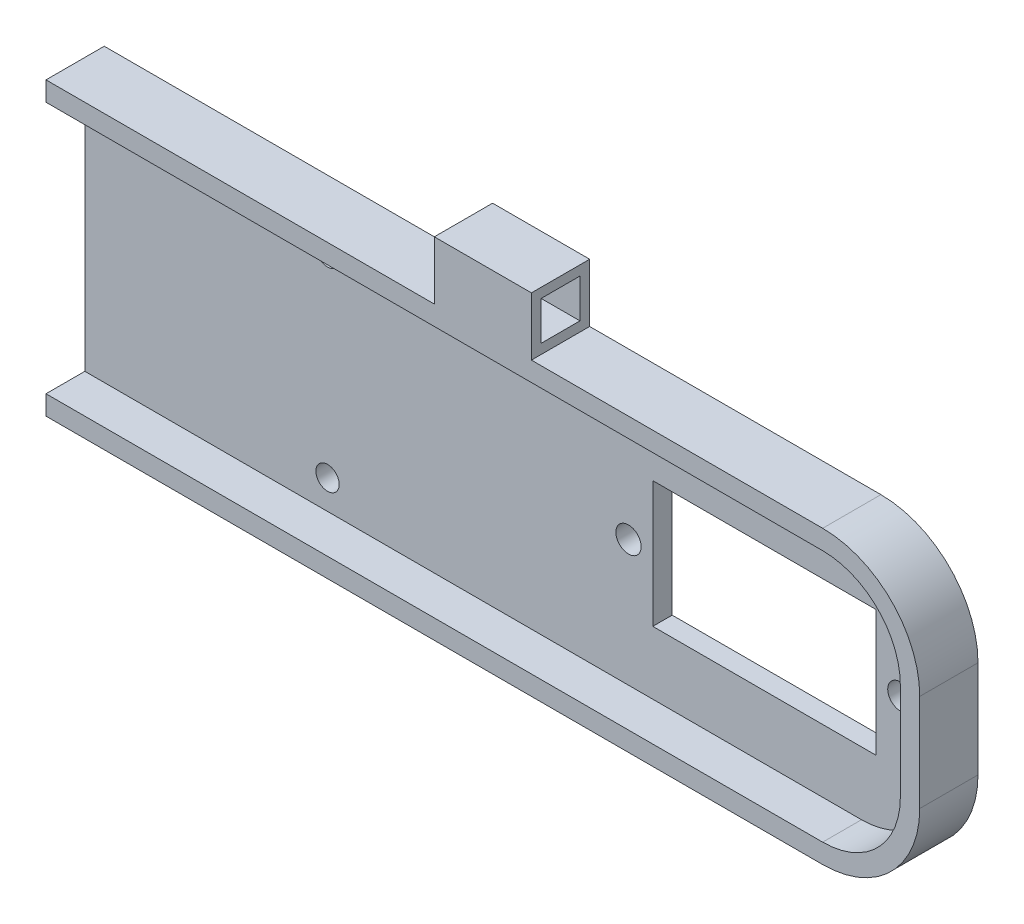
ISO-10303-21;
HEADER;
FILE_DESCRIPTION(('STEP AP214'),'2;1');
FILE_NAME('part.step','',(''),(''),'','','');
FILE_SCHEMA(('AUTOMOTIVE_DESIGN { 1 0 10303 214 1 1 1 1 }'));
ENDSEC;
DATA;
#1=APPLICATION_CONTEXT('core data for automotive mechanical design processes');
#2=APPLICATION_PROTOCOL_DEFINITION('international standard','automotive_design',2000,#1);
#3=PRODUCT_CONTEXT('',#1,'mechanical');
#4=PRODUCT('Part','Part','',(#3));
#5=PRODUCT_RELATED_PRODUCT_CATEGORY('part','',(#4));
#6=PRODUCT_DEFINITION_FORMATION('','',#4);
#7=PRODUCT_DEFINITION_CONTEXT('part definition',#1,'design');
#8=PRODUCT_DEFINITION('design','',#6,#7);
#9=PRODUCT_DEFINITION_SHAPE('','',#8);
#10=(LENGTH_UNIT() NAMED_UNIT(*) SI_UNIT(.MILLI.,.METRE.));
#11=(NAMED_UNIT(*) PLANE_ANGLE_UNIT() SI_UNIT($,.RADIAN.));
#12=(NAMED_UNIT(*) SI_UNIT($,.STERADIAN.) SOLID_ANGLE_UNIT());
#13=UNCERTAINTY_MEASURE_WITH_UNIT(LENGTH_MEASURE(1.E-05),#10,'distance_accuracy_value','');
#14=(GEOMETRIC_REPRESENTATION_CONTEXT(3) GLOBAL_UNCERTAINTY_ASSIGNED_CONTEXT((#13)) GLOBAL_UNIT_ASSIGNED_CONTEXT((#10,
#11,#12)) REPRESENTATION_CONTEXT('',''));
#15=CARTESIAN_POINT('',(0.,0.,0.));
#16=DIRECTION('',(0.,0.,1.));
#17=DIRECTION('',(1.,0.,0.));
#18=AXIS2_PLACEMENT_3D('',#15,#16,#17);
#19=CARTESIAN_POINT('',(80.,0.,0.));
#20=DIRECTION('',(1.,0.,0.));
#21=DIRECTION('',(0.,0.,-1.));
#22=AXIS2_PLACEMENT_3D('',#19,#20,#21);
#23=PLANE('',#22);
#24=DIRECTION('',(0.,0.,1.));
#25=VECTOR('',#24,1.);
#26=CARTESIAN_POINT('',(80.,15.,6.));
#27=LINE('',#26,#25);
#28=CARTESIAN_POINT('',(80.,15.,0.));
#29=VERTEX_POINT('',#28);
#30=CARTESIAN_POINT('',(80.,15.,6.));
#31=VERTEX_POINT('',#30);
#32=EDGE_CURVE('E617',#29,#31,#27,.T.);
#33=ORIENTED_EDGE('',*,*,#32,.F.);
#34=DIRECTION('',(0.,1.,0.));
#35=VECTOR('',#34,1.);
#36=CARTESIAN_POINT('',(80.,0.,0.));
#37=LINE('',#36,#35);
#38=CARTESIAN_POINT('',(80.,-15.,0.));
#39=VERTEX_POINT('',#38);
#40=EDGE_CURVE('E624',#39,#29,#37,.T.);
#41=ORIENTED_EDGE('',*,*,#40,.F.);
#42=DIRECTION('',(0.,0.,-1.));
#43=VECTOR('',#42,1.);
#44=CARTESIAN_POINT('',(80.,-15.,6.));
#45=LINE('',#44,#43);
#46=CARTESIAN_POINT('',(80.,-15.,6.));
#47=VERTEX_POINT('',#46);
#48=EDGE_CURVE('E730',#47,#39,#45,.T.);
#49=ORIENTED_EDGE('',*,*,#48,.F.);
#50=DIRECTION('',(0.,1.,0.));
#51=VECTOR('',#50,1.);
#52=CARTESIAN_POINT('',(80.,0.,6.));
#53=LINE('',#52,#51);
#54=CARTESIAN_POINT('',(80.,-13.,6.));
#55=VERTEX_POINT('',#54);
#56=EDGE_CURVE('E61',#47,#55,#53,.T.);
#57=ORIENTED_EDGE('',*,*,#56,.T.);
#58=DIRECTION('',(0.,0.,1.));
#59=VECTOR('',#58,1.);
#60=CARTESIAN_POINT('',(80.,-13.,2.));
#61=LINE('',#60,#59);
#62=CARTESIAN_POINT('',(80.,-13.,2.));
#63=VERTEX_POINT('',#62);
#64=EDGE_CURVE('E13',#63,#55,#61,.T.);
#65=ORIENTED_EDGE('',*,*,#64,.F.);
#66=DIRECTION('',(0.,1.,0.));
#67=VECTOR('',#66,1.);
#68=CARTESIAN_POINT('',(80.,0.,2.));
#69=LINE('',#68,#67);
#70=CARTESIAN_POINT('',(80.,13.,2.));
#71=VERTEX_POINT('',#70);
#72=EDGE_CURVE('E205',#63,#71,#69,.T.);
#73=ORIENTED_EDGE('',*,*,#72,.T.);
#74=DIRECTION('',(0.,0.,-1.));
#75=VECTOR('',#74,1.);
#76=CARTESIAN_POINT('',(80.,13.,2.));
#77=LINE('',#76,#75);
#78=CARTESIAN_POINT('',(80.,13.,6.));
#79=VERTEX_POINT('',#78);
#80=EDGE_CURVE('E220',#79,#71,#77,.T.);
#81=ORIENTED_EDGE('',*,*,#80,.F.);
#82=EDGE_CURVE('E729',#79,#31,#53,.T.);
#83=ORIENTED_EDGE('',*,*,#82,.T.);
#84=EDGE_LOOP('',(#33,#41,#49,#57,#65,#73,#81,#83));
#85=FACE_BOUND('',#84,.T.);
#86=ADVANCED_FACE('F46',(#85),#23,.F.);
#87=CARTESIAN_POINT('',(-50.,15.,6.));
#88=DIRECTION('',(0.,-1.,0.));
#89=DIRECTION('',(0.,0.,-1.));
#90=AXIS2_PLACEMENT_3D('',#87,#88,#89);
#91=PLANE('',#90);
#92=DIRECTION('',(-1.,0.,0.));
#93=VECTOR('',#92,1.);
#94=CARTESIAN_POINT('',(-50.,15.,0.));
#95=LINE('',#94,#93);
#96=CARTESIAN_POINT('',(120.,15.,0.));
#97=VERTEX_POINT('',#96);
#98=EDGE_CURVE('E278',#97,#29,#95,.T.);
#99=ORIENTED_EDGE('',*,*,#98,.T.);
#100=ORIENTED_EDGE('',*,*,#32,.T.);
#101=DIRECTION('',(-1.,0.,0.));
#102=VECTOR('',#101,1.);
#103=CARTESIAN_POINT('',(-50.,15.,6.));
#104=LINE('',#103,#102);
#105=CARTESIAN_POINT('',(120.,15.,6.));
#106=VERTEX_POINT('',#105);
#107=EDGE_CURVE('E264',#106,#31,#104,.T.);
#108=ORIENTED_EDGE('',*,*,#107,.F.);
#109=DIRECTION('',(0.,0.,-1.));
#110=VECTOR('',#109,1.);
#111=CARTESIAN_POINT('',(120.,15.,6.));
#112=LINE('',#111,#110);
#113=EDGE_CURVE('E68',#106,#97,#112,.T.);
#114=ORIENTED_EDGE('',*,*,#113,.T.);
#115=EDGE_LOOP('',(#99,#100,#108,#114));
#116=FACE_BOUND('',#115,.T.);
#117=ADVANCED_FACE('F357',(#116),#91,.F.);
#118=DIRECTION('',(0.,0.,-1.));
#119=VECTOR('',#118,1.);
#120=CARTESIAN_POINT('',(130.,15.,6.));
#121=LINE('',#120,#119);
#122=CARTESIAN_POINT('',(130.,15.,6.));
#123=VERTEX_POINT('',#122);
#124=CARTESIAN_POINT('',(130.,15.,0.));
#125=VERTEX_POINT('',#124);
#126=EDGE_CURVE('E630',#123,#125,#121,.T.);
#127=ORIENTED_EDGE('',*,*,#126,.F.);
#128=CARTESIAN_POINT('',(160.,15.,6.));
#129=VERTEX_POINT('',#128);
#130=EDGE_CURVE('E267',#129,#123,#104,.T.);
#131=ORIENTED_EDGE('',*,*,#130,.F.);
#132=DIRECTION('',(0.,0.,-1.));
#133=VECTOR('',#132,1.);
#134=CARTESIAN_POINT('',(160.,15.,6.));
#135=LINE('',#134,#133);
#136=CARTESIAN_POINT('',(160.,15.,0.));
#137=VERTEX_POINT('',#136);
#138=EDGE_CURVE('E54',#129,#137,#135,.T.);
#139=ORIENTED_EDGE('',*,*,#138,.T.);
#140=EDGE_CURVE('E280',#137,#125,#95,.T.);
#141=ORIENTED_EDGE('',*,*,#140,.T.);
#142=EDGE_LOOP('',(#127,#131,#139,#141));
#143=FACE_BOUND('',#142,.T.);
#144=ADVANCED_FACE('F362',(#143),#91,.F.);
#145=CARTESIAN_POINT('',(0.,0.,0.));
#146=DIRECTION('',(0.,0.,1.));
#147=DIRECTION('',(1.,0.,0.));
#148=AXIS2_PLACEMENT_3D('',#145,#146,#147);
#149=PLANE('',#148);
#150=CARTESIAN_POINT('',(105.,-9.99999999999999,0.));
#151=DIRECTION('',(0.,0.,1.));
#152=DIRECTION('',(1.,0.,0.));
#153=AXIS2_PLACEMENT_3D('',#150,#151,#152);
#154=CIRCLE('',#153,1.19999999999999);
#155=CARTESIAN_POINT('',(106.2,-9.99999999999999,0.));
#156=VERTEX_POINT('',#155);
#157=EDGE_CURVE('E666',#156,#156,#154,.T.);
#158=ORIENTED_EDGE('',*,*,#157,.T.);
#159=EDGE_LOOP('',(#158));
#160=FACE_BOUND('',#159,.T.);
#161=CARTESIAN_POINT('',(105.,10.,0.));
#162=DIRECTION('',(0.,0.,1.));
#163=DIRECTION('',(1.,0.,0.));
#164=AXIS2_PLACEMENT_3D('',#161,#162,#163);
#165=CIRCLE('',#164,1.19999999999999);
#166=CARTESIAN_POINT('',(106.2,10.,0.));
#167=VERTEX_POINT('',#166);
#168=EDGE_CURVE('E677',#167,#167,#165,.T.);
#169=ORIENTED_EDGE('',*,*,#168,.T.);
#170=EDGE_LOOP('',(#169));
#171=FACE_BOUND('',#170,.T.);
#172=CARTESIAN_POINT('',(164.,0.,0.));
#173=DIRECTION('',(0.,0.,-1.));
#174=DIRECTION('',(-1.,0.,0.));
#175=AXIS2_PLACEMENT_3D('',#172,#173,#174);
#176=CIRCLE('',#175,1.3);
#177=CARTESIAN_POINT('',(162.7,0.,0.));
#178=VERTEX_POINT('',#177);
#179=EDGE_CURVE('E294',#178,#178,#176,.T.);
#180=ORIENTED_EDGE('',*,*,#179,.F.);
#181=EDGE_LOOP('',(#180));
#182=FACE_BOUND('',#181,.T.);
#183=DIRECTION('',(1.,0.,0.));
#184=VECTOR('',#183,1.);
#185=CARTESIAN_POINT('',(-50.,-15.,0.));
#186=LINE('',#185,#184);
#187=CARTESIAN_POINT('',(160.,-15.,0.));
#188=VERTEX_POINT('',#187);
#189=EDGE_CURVE('E265',#39,#188,#186,.T.);
#190=ORIENTED_EDGE('',*,*,#189,.F.);
#191=ORIENTED_EDGE('',*,*,#40,.T.);
#192=ORIENTED_EDGE('',*,*,#98,.F.);
#193=DIRECTION('',(0.,1.,0.));
#194=VECTOR('',#193,1.);
#195=CARTESIAN_POINT('',(120.,15.,0.));
#196=LINE('',#195,#194);
#197=CARTESIAN_POINT('',(120.,21.,0.));
#198=VERTEX_POINT('',#197);
#199=EDGE_CURVE('E623',#97,#198,#196,.T.);
#200=ORIENTED_EDGE('',*,*,#199,.T.);
#201=DIRECTION('',(1.,0.,0.));
#202=VECTOR('',#201,1.);
#203=CARTESIAN_POINT('',(120.,21.,0.));
#204=LINE('',#203,#202);
#205=CARTESIAN_POINT('',(130.,21.,0.));
#206=VERTEX_POINT('',#205);
#207=EDGE_CURVE('E644',#198,#206,#204,.T.);
#208=ORIENTED_EDGE('',*,*,#207,.T.);
#209=DIRECTION('',(0.,1.,0.));
#210=VECTOR('',#209,1.);
#211=CARTESIAN_POINT('',(130.,15.,0.));
#212=LINE('',#211,#210);
#213=EDGE_CURVE('E645',#125,#206,#212,.T.);
#214=ORIENTED_EDGE('',*,*,#213,.F.);
#215=ORIENTED_EDGE('',*,*,#140,.F.);
#216=CARTESIAN_POINT('',(160.,5.,0.));
#217=DIRECTION('',(0.,0.,1.));
#218=DIRECTION('',(1.,0.,0.));
#219=AXIS2_PLACEMENT_3D('',#216,#217,#218);
#220=CIRCLE('',#219,10.);
#221=CARTESIAN_POINT('',(170.,5.,0.));
#222=VERTEX_POINT('',#221);
#223=EDGE_CURVE('E272',#137,#222,#220,.F.);
#224=ORIENTED_EDGE('',*,*,#223,.T.);
#225=DIRECTION('',(0.,1.,0.));
#226=VECTOR('',#225,1.);
#227=CARTESIAN_POINT('',(170.,15.,0.));
#228=LINE('',#227,#226);
#229=CARTESIAN_POINT('',(170.,-5.,0.));
#230=VERTEX_POINT('',#229);
#231=EDGE_CURVE('E273',#230,#222,#228,.T.);
#232=ORIENTED_EDGE('',*,*,#231,.F.);
#233=CARTESIAN_POINT('',(160.,-5.,0.));
#234=DIRECTION('',(0.,0.,1.));
#235=DIRECTION('',(1.,0.,0.));
#236=AXIS2_PLACEMENT_3D('',#233,#234,#235);
#237=CIRCLE('',#236,10.);
#238=EDGE_CURVE('E609',#230,#188,#237,.F.);
#239=ORIENTED_EDGE('',*,*,#238,.T.);
#240=EDGE_LOOP('',(#190,#191,#192,#200,#208,#214,#215,#224,#232,#239));
#241=FACE_BOUND('',#240,.T.);
#242=DIRECTION('',(0.,1.,0.));
#243=VECTOR('',#242,1.);
#244=CARTESIAN_POINT('',(161.5,6.5,0.));
#245=LINE('',#244,#243);
#246=CARTESIAN_POINT('',(161.5,-6.5,0.));
#247=VERTEX_POINT('',#246);
#248=CARTESIAN_POINT('',(161.5,6.5,0.));
#249=VERTEX_POINT('',#248);
#250=EDGE_CURVE('E304',#247,#249,#245,.T.);
#251=ORIENTED_EDGE('',*,*,#250,.T.);
#252=DIRECTION('',(-1.,0.,0.));
#253=VECTOR('',#252,1.);
#254=CARTESIAN_POINT('',(138.5,6.5,0.));
#255=LINE('',#254,#253);
#256=CARTESIAN_POINT('',(138.5,6.5,0.));
#257=VERTEX_POINT('',#256);
#258=EDGE_CURVE('E309',#249,#257,#255,.T.);
#259=ORIENTED_EDGE('',*,*,#258,.T.);
#260=DIRECTION('',(0.,-1.,0.));
#261=VECTOR('',#260,1.);
#262=CARTESIAN_POINT('',(138.5,6.5,0.));
#263=LINE('',#262,#261);
#264=CARTESIAN_POINT('',(138.5,-6.5,0.));
#265=VERTEX_POINT('',#264);
#266=EDGE_CURVE('E313',#257,#265,#263,.T.);
#267=ORIENTED_EDGE('',*,*,#266,.T.);
#268=DIRECTION('',(1.,0.,0.));
#269=VECTOR('',#268,1.);
#270=CARTESIAN_POINT('',(138.5,-6.5,0.));
#271=LINE('',#270,#269);
#272=EDGE_CURVE('E317',#265,#247,#271,.T.);
#273=ORIENTED_EDGE('',*,*,#272,.T.);
#274=EDGE_LOOP('',(#251,#259,#267,#273));
#275=FACE_BOUND('',#274,.T.);
#276=CARTESIAN_POINT('',(136.,0.,0.));
#277=DIRECTION('',(0.,0.,-1.));
#278=DIRECTION('',(-1.,0.,0.));
#279=AXIS2_PLACEMENT_3D('',#276,#277,#278);
#280=CIRCLE('',#279,1.3);
#281=CARTESIAN_POINT('',(134.7,0.,0.));
#282=VERTEX_POINT('',#281);
#283=EDGE_CURVE('E656',#282,#282,#280,.T.);
#284=ORIENTED_EDGE('',*,*,#283,.F.);
#285=EDGE_LOOP('',(#284));
#286=FACE_BOUND('',#285,.T.);
#287=ADVANCED_FACE('F341',(#160,#171,#182,#241,#275,#286),#149,.F.);
#288=CARTESIAN_POINT('',(0.,0.,2.));
#289=DIRECTION('',(0.,0.,1.));
#290=DIRECTION('',(1.,0.,0.));
#291=AXIS2_PLACEMENT_3D('',#288,#289,#290);
#292=PLANE('',#291);
#293=ORIENTED_EDGE('',*,*,#72,.F.);
#294=DIRECTION('',(1.,0.,0.));
#295=VECTOR('',#294,1.);
#296=CARTESIAN_POINT('',(20.7665596572952,-13.,2.));
#297=LINE('',#296,#295);
#298=CARTESIAN_POINT('',(160.,-13.,2.));
#299=VERTEX_POINT('',#298);
#300=EDGE_CURVE('E215',#63,#299,#297,.T.);
#301=ORIENTED_EDGE('',*,*,#300,.T.);
#302=CARTESIAN_POINT('',(160.,-5.,2.));
#303=DIRECTION('',(0.,0.,1.));
#304=DIRECTION('',(1.,0.,0.));
#305=AXIS2_PLACEMENT_3D('',#302,#303,#304);
#306=CIRCLE('',#305,8.);
#307=CARTESIAN_POINT('',(168.,-5.,2.));
#308=VERTEX_POINT('',#307);
#309=EDGE_CURVE('E226',#299,#308,#306,.T.);
#310=ORIENTED_EDGE('',*,*,#309,.T.);
#311=DIRECTION('',(0.,1.,0.));
#312=VECTOR('',#311,1.);
#313=CARTESIAN_POINT('',(168.,-5.,2.));
#314=LINE('',#313,#312);
#315=CARTESIAN_POINT('',(168.,5.,2.));
#316=VERTEX_POINT('',#315);
#317=EDGE_CURVE('E229',#308,#316,#314,.T.);
#318=ORIENTED_EDGE('',*,*,#317,.T.);
#319=CARTESIAN_POINT('',(160.,5.,2.));
#320=DIRECTION('',(0.,0.,1.));
#321=DIRECTION('',(1.,0.,0.));
#322=AXIS2_PLACEMENT_3D('',#319,#320,#321);
#323=CIRCLE('',#322,7.99999999999999);
#324=CARTESIAN_POINT('',(160.,13.,2.));
#325=VERTEX_POINT('',#324);
#326=EDGE_CURVE('E240',#316,#325,#323,.T.);
#327=ORIENTED_EDGE('',*,*,#326,.T.);
#328=DIRECTION('',(-1.,0.,0.));
#329=VECTOR('',#328,1.);
#330=CARTESIAN_POINT('',(160.,13.,2.));
#331=LINE('',#330,#329);
#332=EDGE_CURVE('E219',#325,#71,#331,.T.);
#333=ORIENTED_EDGE('',*,*,#332,.T.);
#334=EDGE_LOOP('',(#293,#301,#310,#318,#327,#333));
#335=FACE_BOUND('',#334,.T.);
#336=CARTESIAN_POINT('',(105.,-9.99999999999999,2.));
#337=DIRECTION('',(0.,0.,1.));
#338=DIRECTION('',(1.,0.,0.));
#339=AXIS2_PLACEMENT_3D('',#336,#337,#338);
#340=CIRCLE('',#339,1.19999999999999);
#341=CARTESIAN_POINT('',(106.2,-9.99999999999999,2.));
#342=VERTEX_POINT('',#341);
#343=EDGE_CURVE('E673',#342,#342,#340,.T.);
#344=ORIENTED_EDGE('',*,*,#343,.F.);
#345=EDGE_LOOP('',(#344));
#346=FACE_BOUND('',#345,.T.);
#347=CARTESIAN_POINT('',(105.,10.,2.));
#348=DIRECTION('',(0.,0.,1.));
#349=DIRECTION('',(1.,0.,0.));
#350=AXIS2_PLACEMENT_3D('',#347,#348,#349);
#351=CIRCLE('',#350,1.19999999999999);
#352=CARTESIAN_POINT('',(106.2,10.,2.));
#353=VERTEX_POINT('',#352);
#354=EDGE_CURVE('E672',#353,#353,#351,.T.);
#355=ORIENTED_EDGE('',*,*,#354,.F.);
#356=EDGE_LOOP('',(#355));
#357=FACE_BOUND('',#356,.T.);
#358=CARTESIAN_POINT('',(136.,0.,2.));
#359=DIRECTION('',(0.,0.,1.));
#360=DIRECTION('',(1.,0.,0.));
#361=AXIS2_PLACEMENT_3D('',#358,#359,#360);
#362=CIRCLE('',#361,1.3);
#363=CARTESIAN_POINT('',(137.3,0.,2.));
#364=VERTEX_POINT('',#363);
#365=EDGE_CURVE('E661',#364,#364,#362,.T.);
#366=ORIENTED_EDGE('',*,*,#365,.F.);
#367=EDGE_LOOP('',(#366));
#368=FACE_BOUND('',#367,.T.);
#369=CARTESIAN_POINT('',(164.,0.,2.));
#370=DIRECTION('',(0.,0.,1.));
#371=DIRECTION('',(1.,0.,0.));
#372=AXIS2_PLACEMENT_3D('',#369,#370,#371);
#373=CIRCLE('',#372,1.3);
#374=CARTESIAN_POINT('',(165.3,0.,2.));
#375=VERTEX_POINT('',#374);
#376=EDGE_CURVE('E287',#375,#375,#373,.T.);
#377=ORIENTED_EDGE('',*,*,#376,.F.);
#378=EDGE_LOOP('',(#377));
#379=FACE_BOUND('',#378,.T.);
#380=DIRECTION('',(-1.,0.,0.));
#381=VECTOR('',#380,1.);
#382=CARTESIAN_POINT('',(138.5,6.5,2.));
#383=LINE('',#382,#381);
#384=CARTESIAN_POINT('',(161.5,6.5,2.));
#385=VERTEX_POINT('',#384);
#386=CARTESIAN_POINT('',(138.5,6.5,2.));
#387=VERTEX_POINT('',#386);
#388=EDGE_CURVE('E298',#385,#387,#383,.T.);
#389=ORIENTED_EDGE('',*,*,#388,.F.);
#390=DIRECTION('',(0.,1.,0.));
#391=VECTOR('',#390,1.);
#392=CARTESIAN_POINT('',(161.5,6.5,2.));
#393=LINE('',#392,#391);
#394=CARTESIAN_POINT('',(161.5,-6.5,2.));
#395=VERTEX_POINT('',#394);
#396=EDGE_CURVE('E300',#395,#385,#393,.T.);
#397=ORIENTED_EDGE('',*,*,#396,.F.);
#398=DIRECTION('',(1.,0.,0.));
#399=VECTOR('',#398,1.);
#400=CARTESIAN_POINT('',(138.5,-6.5,2.));
#401=LINE('',#400,#399);
#402=CARTESIAN_POINT('',(138.5,-6.5,2.));
#403=VERTEX_POINT('',#402);
#404=EDGE_CURVE('E235',#403,#395,#401,.T.);
#405=ORIENTED_EDGE('',*,*,#404,.F.);
#406=DIRECTION('',(0.,-1.,0.));
#407=VECTOR('',#406,1.);
#408=CARTESIAN_POINT('',(138.5,6.5,2.));
#409=LINE('',#408,#407);
#410=EDGE_CURVE('E293',#387,#403,#409,.T.);
#411=ORIENTED_EDGE('',*,*,#410,.F.);
#412=EDGE_LOOP('',(#389,#397,#405,#411));
#413=FACE_BOUND('',#412,.T.);
#414=ADVANCED_FACE('F212',(#335,#346,#357,#368,#379,#413),#292,.T.);
#415=CARTESIAN_POINT('',(170.,15.,6.));
#416=DIRECTION('',(-1.,0.,0.));
#417=DIRECTION('',(0.,0.,1.));
#418=AXIS2_PLACEMENT_3D('',#415,#416,#417);
#419=PLANE('',#418);
#420=DIRECTION('',(0.,1.,0.));
#421=VECTOR('',#420,1.);
#422=CARTESIAN_POINT('',(170.,15.,6.));
#423=LINE('',#422,#421);
#424=CARTESIAN_POINT('',(170.,-5.,6.));
#425=VERTEX_POINT('',#424);
#426=CARTESIAN_POINT('',(170.,5.,6.));
#427=VERTEX_POINT('',#426);
#428=EDGE_CURVE('E258',#425,#427,#423,.T.);
#429=ORIENTED_EDGE('',*,*,#428,.F.);
#430=DIRECTION('',(0.,0.,-1.));
#431=VECTOR('',#430,1.);
#432=CARTESIAN_POINT('',(170.,-5.,6.));
#433=LINE('',#432,#431);
#434=EDGE_CURVE('E598',#425,#230,#433,.T.);
#435=ORIENTED_EDGE('',*,*,#434,.T.);
#436=ORIENTED_EDGE('',*,*,#231,.T.);
#437=DIRECTION('',(0.,0.,-1.));
#438=VECTOR('',#437,1.);
#439=CARTESIAN_POINT('',(170.,5.,6.));
#440=LINE('',#439,#438);
#441=EDGE_CURVE('E607',#222,#427,#440,.F.);
#442=ORIENTED_EDGE('',*,*,#441,.T.);
#443=EDGE_LOOP('',(#429,#435,#436,#442));
#444=FACE_BOUND('',#443,.T.);
#445=ADVANCED_FACE('F493',(#444),#419,.F.);
#446=CARTESIAN_POINT('',(0.,0.,6.));
#447=DIRECTION('',(0.,0.,1.));
#448=DIRECTION('',(1.,0.,0.));
#449=AXIS2_PLACEMENT_3D('',#446,#447,#448);
#450=PLANE('',#449);
#451=ORIENTED_EDGE('',*,*,#56,.F.);
#452=DIRECTION('',(1.,0.,0.));
#453=VECTOR('',#452,1.);
#454=CARTESIAN_POINT('',(-50.,-15.,6.));
#455=LINE('',#454,#453);
#456=CARTESIAN_POINT('',(160.,-15.,6.));
#457=VERTEX_POINT('',#456);
#458=EDGE_CURVE('E270',#47,#457,#455,.T.);
#459=ORIENTED_EDGE('',*,*,#458,.T.);
#460=CARTESIAN_POINT('',(160.,-5.,6.));
#461=DIRECTION('',(0.,0.,1.));
#462=DIRECTION('',(1.,0.,0.));
#463=AXIS2_PLACEMENT_3D('',#460,#461,#462);
#464=CIRCLE('',#463,10.);
#465=EDGE_CURVE('E594',#457,#425,#464,.T.);
#466=ORIENTED_EDGE('',*,*,#465,.T.);
#467=ORIENTED_EDGE('',*,*,#428,.T.);
#468=CARTESIAN_POINT('',(160.,5.,6.));
#469=DIRECTION('',(0.,0.,1.));
#470=DIRECTION('',(1.,0.,0.));
#471=AXIS2_PLACEMENT_3D('',#468,#469,#470);
#472=CIRCLE('',#471,10.);
#473=EDGE_CURVE('E600',#427,#129,#472,.T.);
#474=ORIENTED_EDGE('',*,*,#473,.T.);
#475=ORIENTED_EDGE('',*,*,#130,.T.);
#476=DIRECTION('',(0.,-1.,0.));
#477=VECTOR('',#476,1.);
#478=CARTESIAN_POINT('',(130.,15.,6.));
#479=LINE('',#478,#477);
#480=CARTESIAN_POINT('',(130.,21.,6.));
#481=VERTEX_POINT('',#480);
#482=EDGE_CURVE('E635',#481,#123,#479,.T.);
#483=ORIENTED_EDGE('',*,*,#482,.F.);
#484=DIRECTION('',(1.,0.,0.));
#485=VECTOR('',#484,1.);
#486=CARTESIAN_POINT('',(120.,21.,6.));
#487=LINE('',#486,#485);
#488=CARTESIAN_POINT('',(120.,21.,6.));
#489=VERTEX_POINT('',#488);
#490=EDGE_CURVE('E654',#489,#481,#487,.T.);
#491=ORIENTED_EDGE('',*,*,#490,.F.);
#492=DIRECTION('',(0.,-1.,0.));
#493=VECTOR('',#492,1.);
#494=CARTESIAN_POINT('',(120.,15.,6.));
#495=LINE('',#494,#493);
#496=EDGE_CURVE('E632',#489,#106,#495,.T.);
#497=ORIENTED_EDGE('',*,*,#496,.T.);
#498=ORIENTED_EDGE('',*,*,#107,.T.);
#499=ORIENTED_EDGE('',*,*,#82,.F.);
#500=DIRECTION('',(-1.,0.,0.));
#501=VECTOR('',#500,1.);
#502=CARTESIAN_POINT('',(160.,13.,6.));
#503=LINE('',#502,#501);
#504=CARTESIAN_POINT('',(160.,13.,6.));
#505=VERTEX_POINT('',#504);
#506=EDGE_CURVE('E227',#505,#79,#503,.T.);
#507=ORIENTED_EDGE('',*,*,#506,.F.);
#508=CARTESIAN_POINT('',(160.,5.,6.));
#509=DIRECTION('',(0.,0.,1.));
#510=DIRECTION('',(1.,0.,0.));
#511=AXIS2_PLACEMENT_3D('',#508,#509,#510);
#512=CIRCLE('',#511,7.99999999999999);
#513=CARTESIAN_POINT('',(168.,5.,6.));
#514=VERTEX_POINT('',#513);
#515=EDGE_CURVE('E232',#514,#505,#512,.T.);
#516=ORIENTED_EDGE('',*,*,#515,.F.);
#517=DIRECTION('',(0.,1.,0.));
#518=VECTOR('',#517,1.);
#519=CARTESIAN_POINT('',(168.,-5.,6.));
#520=LINE('',#519,#518);
#521=CARTESIAN_POINT('',(168.,-5.,6.));
#522=VERTEX_POINT('',#521);
#523=EDGE_CURVE('E248',#522,#514,#520,.T.);
#524=ORIENTED_EDGE('',*,*,#523,.F.);
#525=CARTESIAN_POINT('',(160.,-5.,6.));
#526=DIRECTION('',(0.,0.,1.));
#527=DIRECTION('',(1.,0.,0.));
#528=AXIS2_PLACEMENT_3D('',#525,#526,#527);
#529=CIRCLE('',#528,8.);
#530=CARTESIAN_POINT('',(160.,-13.,6.));
#531=VERTEX_POINT('',#530);
#532=EDGE_CURVE('E245',#531,#522,#529,.T.);
#533=ORIENTED_EDGE('',*,*,#532,.F.);
#534=DIRECTION('',(1.,0.,0.));
#535=VECTOR('',#534,1.);
#536=CARTESIAN_POINT('',(20.7665596572952,-13.,6.));
#537=LINE('',#536,#535);
#538=EDGE_CURVE('E243',#55,#531,#537,.T.);
#539=ORIENTED_EDGE('',*,*,#538,.F.);
#540=EDGE_LOOP('',(#451,#459,#466,#467,#474,#475,#483,#491,#497,#498,#499,#507,#516,#524,#533,#539));
#541=FACE_BOUND('',#540,.T.);
#542=ADVANCED_FACE('F500',(#541),#450,.T.);
#543=CARTESIAN_POINT('',(-50.,-15.,6.));
#544=DIRECTION('',(0.,1.,0.));
#545=DIRECTION('',(0.,0.,1.));
#546=AXIS2_PLACEMENT_3D('',#543,#544,#545);
#547=PLANE('',#546);
#548=ORIENTED_EDGE('',*,*,#458,.F.);
#549=ORIENTED_EDGE('',*,*,#48,.T.);
#550=ORIENTED_EDGE('',*,*,#189,.T.);
#551=DIRECTION('',(0.,0.,-1.));
#552=VECTOR('',#551,1.);
#553=CARTESIAN_POINT('',(160.,-15.,6.));
#554=LINE('',#553,#552);
#555=EDGE_CURVE('E596',#188,#457,#554,.F.);
#556=ORIENTED_EDGE('',*,*,#555,.T.);
#557=EDGE_LOOP('',(#548,#549,#550,#556));
#558=FACE_BOUND('',#557,.T.);
#559=ADVANCED_FACE('F504',(#558),#547,.F.);
#560=CARTESIAN_POINT('',(160.,-5.,6.));
#561=DIRECTION('',(0.,0.,-1.));
#562=DIRECTION('',(-1.,0.,0.));
#563=AXIS2_PLACEMENT_3D('',#560,#561,#562);
#564=CYLINDRICAL_SURFACE('',#563,10.);
#565=ORIENTED_EDGE('',*,*,#465,.F.);
#566=ORIENTED_EDGE('',*,*,#555,.F.);
#567=ORIENTED_EDGE('',*,*,#238,.F.);
#568=ORIENTED_EDGE('',*,*,#434,.F.);
#569=EDGE_LOOP('',(#565,#566,#567,#568));
#570=FACE_BOUND('',#569,.T.);
#571=ADVANCED_FACE('F516',(#570),#564,.T.);
#572=CARTESIAN_POINT('',(160.,5.,6.));
#573=DIRECTION('',(0.,0.,-1.));
#574=DIRECTION('',(-1.,0.,0.));
#575=AXIS2_PLACEMENT_3D('',#572,#573,#574);
#576=CYLINDRICAL_SURFACE('',#575,10.);
#577=ORIENTED_EDGE('',*,*,#473,.F.);
#578=ORIENTED_EDGE('',*,*,#441,.F.);
#579=ORIENTED_EDGE('',*,*,#223,.F.);
#580=ORIENTED_EDGE('',*,*,#138,.F.);
#581=EDGE_LOOP('',(#577,#578,#579,#580));
#582=FACE_BOUND('',#581,.T.);
#583=ADVANCED_FACE('F48',(#582),#576,.T.);
#584=CARTESIAN_POINT('',(160.,13.,2.));
#585=DIRECTION('',(0.,1.,0.));
#586=DIRECTION('',(-1.,0.,0.));
#587=AXIS2_PLACEMENT_3D('',#584,#585,#586);
#588=PLANE('',#587);
#589=ORIENTED_EDGE('',*,*,#506,.T.);
#590=ORIENTED_EDGE('',*,*,#80,.T.);
#591=ORIENTED_EDGE('',*,*,#332,.F.);
#592=DIRECTION('',(0.,0.,1.));
#593=VECTOR('',#592,1.);
#594=CARTESIAN_POINT('',(160.,13.,2.));
#595=LINE('',#594,#593);
#596=EDGE_CURVE('E279',#325,#505,#595,.T.);
#597=ORIENTED_EDGE('',*,*,#596,.T.);
#598=EDGE_LOOP('',(#589,#590,#591,#597));
#599=FACE_BOUND('',#598,.T.);
#600=ADVANCED_FACE('F525',(#599),#588,.F.);
#601=CARTESIAN_POINT('',(160.,5.,2.));
#602=DIRECTION('',(0.,0.,1.));
#603=DIRECTION('',(1.,0.,0.));
#604=AXIS2_PLACEMENT_3D('',#601,#602,#603);
#605=CYLINDRICAL_SURFACE('',#604,7.99999999999999);
#606=ORIENTED_EDGE('',*,*,#515,.T.);
#607=ORIENTED_EDGE('',*,*,#596,.F.);
#608=ORIENTED_EDGE('',*,*,#326,.F.);
#609=DIRECTION('',(0.,0.,1.));
#610=VECTOR('',#609,1.);
#611=CARTESIAN_POINT('',(168.,5.,2.));
#612=LINE('',#611,#610);
#613=EDGE_CURVE('E760',#316,#514,#612,.T.);
#614=ORIENTED_EDGE('',*,*,#613,.T.);
#615=EDGE_LOOP('',(#606,#607,#608,#614));
#616=FACE_BOUND('',#615,.T.);
#617=ADVANCED_FACE('F530',(#616),#605,.F.);
#618=CARTESIAN_POINT('',(168.,-5.,2.));
#619=DIRECTION('',(1.,0.,0.));
#620=DIRECTION('',(0.,0.,-1.));
#621=AXIS2_PLACEMENT_3D('',#618,#619,#620);
#622=PLANE('',#621);
#623=ORIENTED_EDGE('',*,*,#523,.T.);
#624=ORIENTED_EDGE('',*,*,#613,.F.);
#625=ORIENTED_EDGE('',*,*,#317,.F.);
#626=DIRECTION('',(0.,0.,1.));
#627=VECTOR('',#626,1.);
#628=CARTESIAN_POINT('',(168.,-5.,2.));
#629=LINE('',#628,#627);
#630=EDGE_CURVE('E763',#308,#522,#629,.T.);
#631=ORIENTED_EDGE('',*,*,#630,.T.);
#632=EDGE_LOOP('',(#623,#624,#625,#631));
#633=FACE_BOUND('',#632,.T.);
#634=ADVANCED_FACE('F765',(#633),#622,.F.);
#635=CARTESIAN_POINT('',(160.,-5.,2.));
#636=DIRECTION('',(0.,0.,1.));
#637=DIRECTION('',(1.,0.,0.));
#638=AXIS2_PLACEMENT_3D('',#635,#636,#637);
#639=CYLINDRICAL_SURFACE('',#638,8.);
#640=ORIENTED_EDGE('',*,*,#532,.T.);
#641=ORIENTED_EDGE('',*,*,#630,.F.);
#642=ORIENTED_EDGE('',*,*,#309,.F.);
#643=DIRECTION('',(0.,0.,1.));
#644=VECTOR('',#643,1.);
#645=CARTESIAN_POINT('',(160.,-13.,2.));
#646=LINE('',#645,#644);
#647=EDGE_CURVE('E224',#299,#531,#646,.T.);
#648=ORIENTED_EDGE('',*,*,#647,.T.);
#649=EDGE_LOOP('',(#640,#641,#642,#648));
#650=FACE_BOUND('',#649,.T.);
#651=ADVANCED_FACE('F539',(#650),#639,.F.);
#652=CARTESIAN_POINT('',(20.7665596572952,-13.,2.));
#653=DIRECTION('',(0.,-1.,0.));
#654=DIRECTION('',(0.,0.,-1.));
#655=AXIS2_PLACEMENT_3D('',#652,#653,#654);
#656=PLANE('',#655);
#657=ORIENTED_EDGE('',*,*,#300,.F.);
#658=ORIENTED_EDGE('',*,*,#64,.T.);
#659=ORIENTED_EDGE('',*,*,#538,.T.);
#660=ORIENTED_EDGE('',*,*,#647,.F.);
#661=EDGE_LOOP('',(#657,#658,#659,#660));
#662=FACE_BOUND('',#661,.T.);
#663=ADVANCED_FACE('F222',(#662),#656,.F.);
#664=CARTESIAN_POINT('',(161.5,6.5,13.001));
#665=DIRECTION('',(-1.,0.,0.));
#666=DIRECTION('',(0.,0.,1.));
#667=AXIS2_PLACEMENT_3D('',#664,#665,#666);
#668=PLANE('',#667);
#669=ORIENTED_EDGE('',*,*,#396,.T.);
#670=DIRECTION('',(0.,0.,-1.));
#671=VECTOR('',#670,1.);
#672=CARTESIAN_POINT('',(161.5,6.5,13.001));
#673=LINE('',#672,#671);
#674=EDGE_CURVE('E326',#385,#249,#673,.T.);
#675=ORIENTED_EDGE('',*,*,#674,.T.);
#676=ORIENTED_EDGE('',*,*,#250,.F.);
#677=DIRECTION('',(0.,0.,-1.));
#678=VECTOR('',#677,1.);
#679=CARTESIAN_POINT('',(161.5,-6.5,13.001));
#680=LINE('',#679,#678);
#681=EDGE_CURVE('E320',#395,#247,#680,.T.);
#682=ORIENTED_EDGE('',*,*,#681,.F.);
#683=EDGE_LOOP('',(#669,#675,#676,#682));
#684=FACE_BOUND('',#683,.T.);
#685=ADVANCED_FACE('F339',(#684),#668,.T.);
#686=CARTESIAN_POINT('',(138.5,6.5,13.001));
#687=DIRECTION('',(0.,-1.,0.));
#688=DIRECTION('',(0.,0.,-1.));
#689=AXIS2_PLACEMENT_3D('',#686,#687,#688);
#690=PLANE('',#689);
#691=ORIENTED_EDGE('',*,*,#388,.T.);
#692=DIRECTION('',(0.,0.,-1.));
#693=VECTOR('',#692,1.);
#694=CARTESIAN_POINT('',(138.5,6.5,13.001));
#695=LINE('',#694,#693);
#696=EDGE_CURVE('E325',#387,#257,#695,.T.);
#697=ORIENTED_EDGE('',*,*,#696,.T.);
#698=ORIENTED_EDGE('',*,*,#258,.F.);
#699=ORIENTED_EDGE('',*,*,#674,.F.);
#700=EDGE_LOOP('',(#691,#697,#698,#699));
#701=FACE_BOUND('',#700,.T.);
#702=ADVANCED_FACE('F347',(#701),#690,.T.);
#703=CARTESIAN_POINT('',(138.5,6.5,13.001));
#704=DIRECTION('',(1.,0.,0.));
#705=DIRECTION('',(0.,0.,-1.));
#706=AXIS2_PLACEMENT_3D('',#703,#704,#705);
#707=PLANE('',#706);
#708=ORIENTED_EDGE('',*,*,#410,.T.);
#709=DIRECTION('',(0.,0.,-1.));
#710=VECTOR('',#709,1.);
#711=CARTESIAN_POINT('',(138.5,-6.5,13.001));
#712=LINE('',#711,#710);
#713=EDGE_CURVE('E323',#403,#265,#712,.T.);
#714=ORIENTED_EDGE('',*,*,#713,.T.);
#715=ORIENTED_EDGE('',*,*,#266,.F.);
#716=ORIENTED_EDGE('',*,*,#696,.F.);
#717=EDGE_LOOP('',(#708,#714,#715,#716));
#718=FACE_BOUND('',#717,.T.);
#719=ADVANCED_FACE('F345',(#718),#707,.T.);
#720=CARTESIAN_POINT('',(138.5,-6.5,13.001));
#721=DIRECTION('',(0.,1.,0.));
#722=DIRECTION('',(0.,0.,1.));
#723=AXIS2_PLACEMENT_3D('',#720,#721,#722);
#724=PLANE('',#723);
#725=ORIENTED_EDGE('',*,*,#404,.T.);
#726=ORIENTED_EDGE('',*,*,#681,.T.);
#727=ORIENTED_EDGE('',*,*,#272,.F.);
#728=ORIENTED_EDGE('',*,*,#713,.F.);
#729=EDGE_LOOP('',(#725,#726,#727,#728));
#730=FACE_BOUND('',#729,.T.);
#731=ADVANCED_FACE('F334',(#730),#724,.T.);
#732=CARTESIAN_POINT('',(164.,0.,0.));
#733=DIRECTION('',(0.,0.,-1.));
#734=DIRECTION('',(-1.,0.,0.));
#735=AXIS2_PLACEMENT_3D('',#732,#733,#734);
#736=CYLINDRICAL_SURFACE('',#735,1.3);
#737=ORIENTED_EDGE('',*,*,#179,.T.);
#738=EDGE_LOOP('',(#737));
#739=FACE_BOUND('',#738,.T.);
#740=ORIENTED_EDGE('',*,*,#376,.T.);
#741=EDGE_LOOP('',(#740));
#742=FACE_BOUND('',#741,.T.);
#743=ADVANCED_FACE('F404',(#739,#742),#736,.F.);
#744=CARTESIAN_POINT('',(136.,0.,0.));
#745=DIRECTION('',(0.,0.,-1.));
#746=DIRECTION('',(-1.,0.,0.));
#747=AXIS2_PLACEMENT_3D('',#744,#745,#746);
#748=CYLINDRICAL_SURFACE('',#747,1.3);
#749=ORIENTED_EDGE('',*,*,#283,.T.);
#750=EDGE_LOOP('',(#749));
#751=FACE_BOUND('',#750,.T.);
#752=ORIENTED_EDGE('',*,*,#365,.T.);
#753=EDGE_LOOP('',(#752));
#754=FACE_BOUND('',#753,.T.);
#755=ADVANCED_FACE('F400',(#751,#754),#748,.F.);
#756=CARTESIAN_POINT('',(120.,21.,6.));
#757=DIRECTION('',(0.,1.,0.));
#758=DIRECTION('',(0.,0.,1.));
#759=AXIS2_PLACEMENT_3D('',#756,#757,#758);
#760=PLANE('',#759);
#761=DIRECTION('',(0.,0.,1.));
#762=VECTOR('',#761,1.);
#763=CARTESIAN_POINT('',(130.,21.,6.));
#764=LINE('',#763,#762);
#765=EDGE_CURVE('E648',#206,#481,#764,.T.);
#766=ORIENTED_EDGE('',*,*,#765,.F.);
#767=ORIENTED_EDGE('',*,*,#207,.F.);
#768=DIRECTION('',(0.,0.,1.));
#769=VECTOR('',#768,1.);
#770=CARTESIAN_POINT('',(120.,21.,6.));
#771=LINE('',#770,#769);
#772=EDGE_CURVE('E629',#198,#489,#771,.T.);
#773=ORIENTED_EDGE('',*,*,#772,.T.);
#774=ORIENTED_EDGE('',*,*,#490,.T.);
#775=EDGE_LOOP('',(#766,#767,#773,#774));
#776=FACE_BOUND('',#775,.T.);
#777=ADVANCED_FACE('F393',(#776),#760,.T.);
#778=CARTESIAN_POINT('',(120.,0.,0.));
#779=DIRECTION('',(-1.,0.,0.));
#780=DIRECTION('',(0.,0.,1.));
#781=AXIS2_PLACEMENT_3D('',#778,#779,#780);
#782=PLANE('',#781);
#783=DIRECTION('',(0.,-1.,0.));
#784=VECTOR('',#783,1.);
#785=CARTESIAN_POINT('',(120.,16.,5.));
#786=LINE('',#785,#784);
#787=CARTESIAN_POINT('',(120.,20.,5.));
#788=VERTEX_POINT('',#787);
#789=CARTESIAN_POINT('',(120.,16.,5.));
#790=VERTEX_POINT('',#789);
#791=EDGE_CURVE('E683',#788,#790,#786,.T.);
#792=ORIENTED_EDGE('',*,*,#791,.T.);
#793=DIRECTION('',(0.,0.,-1.));
#794=VECTOR('',#793,1.);
#795=CARTESIAN_POINT('',(120.,16.,5.));
#796=LINE('',#795,#794);
#797=CARTESIAN_POINT('',(120.,16.,1.));
#798=VERTEX_POINT('',#797);
#799=EDGE_CURVE('E687',#790,#798,#796,.T.);
#800=ORIENTED_EDGE('',*,*,#799,.T.);
#801=DIRECTION('',(0.,1.,0.));
#802=VECTOR('',#801,1.);
#803=CARTESIAN_POINT('',(120.,16.,1.));
#804=LINE('',#803,#802);
#805=CARTESIAN_POINT('',(120.,20.,1.));
#806=VERTEX_POINT('',#805);
#807=EDGE_CURVE('E691',#798,#806,#804,.T.);
#808=ORIENTED_EDGE('',*,*,#807,.T.);
#809=DIRECTION('',(0.,0.,1.));
#810=VECTOR('',#809,1.);
#811=CARTESIAN_POINT('',(120.,20.,5.));
#812=LINE('',#811,#810);
#813=EDGE_CURVE('E694',#806,#788,#812,.T.);
#814=ORIENTED_EDGE('',*,*,#813,.T.);
#815=EDGE_LOOP('',(#792,#800,#808,#814));
#816=FACE_BOUND('',#815,.T.);
#817=ORIENTED_EDGE('',*,*,#199,.F.);
#818=ORIENTED_EDGE('',*,*,#113,.F.);
#819=ORIENTED_EDGE('',*,*,#496,.F.);
#820=ORIENTED_EDGE('',*,*,#772,.F.);
#821=EDGE_LOOP('',(#817,#818,#819,#820));
#822=FACE_BOUND('',#821,.T.);
#823=ADVANCED_FACE('F390',(#816,#822),#782,.T.);
#824=CARTESIAN_POINT('',(130.,0.,0.));
#825=DIRECTION('',(-1.,0.,0.));
#826=DIRECTION('',(0.,0.,1.));
#827=AXIS2_PLACEMENT_3D('',#824,#825,#826);
#828=PLANE('',#827);
#829=DIRECTION('',(0.,0.,-1.));
#830=VECTOR('',#829,1.);
#831=CARTESIAN_POINT('',(130.,16.,5.));
#832=LINE('',#831,#830);
#833=CARTESIAN_POINT('',(130.,16.,5.));
#834=VERTEX_POINT('',#833);
#835=CARTESIAN_POINT('',(130.,16.,1.));
#836=VERTEX_POINT('',#835);
#837=EDGE_CURVE('E698',#834,#836,#832,.T.);
#838=ORIENTED_EDGE('',*,*,#837,.F.);
#839=DIRECTION('',(0.,-1.,0.));
#840=VECTOR('',#839,1.);
#841=CARTESIAN_POINT('',(130.,16.,5.));
#842=LINE('',#841,#840);
#843=CARTESIAN_POINT('',(130.,20.,5.));
#844=VERTEX_POINT('',#843);
#845=EDGE_CURVE('E682',#844,#834,#842,.T.);
#846=ORIENTED_EDGE('',*,*,#845,.F.);
#847=DIRECTION('',(0.,0.,1.));
#848=VECTOR('',#847,1.);
#849=CARTESIAN_POINT('',(130.,20.,5.));
#850=LINE('',#849,#848);
#851=CARTESIAN_POINT('',(130.,20.,1.));
#852=VERTEX_POINT('',#851);
#853=EDGE_CURVE('E688',#852,#844,#850,.T.);
#854=ORIENTED_EDGE('',*,*,#853,.F.);
#855=DIRECTION('',(0.,1.,0.));
#856=VECTOR('',#855,1.);
#857=CARTESIAN_POINT('',(130.,16.,1.));
#858=LINE('',#857,#856);
#859=EDGE_CURVE('E701',#836,#852,#858,.T.);
#860=ORIENTED_EDGE('',*,*,#859,.F.);
#861=EDGE_LOOP('',(#838,#846,#854,#860));
#862=FACE_BOUND('',#861,.T.);
#863=ORIENTED_EDGE('',*,*,#213,.T.);
#864=ORIENTED_EDGE('',*,*,#765,.T.);
#865=ORIENTED_EDGE('',*,*,#482,.T.);
#866=ORIENTED_EDGE('',*,*,#126,.T.);
#867=EDGE_LOOP('',(#863,#864,#865,#866));
#868=FACE_BOUND('',#867,.T.);
#869=ADVANCED_FACE('F388',(#862,#868),#828,.F.);
#870=CARTESIAN_POINT('',(120.,16.,5.));
#871=DIRECTION('',(0.,0.,1.));
#872=DIRECTION('',(1.,0.,0.));
#873=AXIS2_PLACEMENT_3D('',#870,#871,#872);
#874=PLANE('',#873);
#875=ORIENTED_EDGE('',*,*,#845,.T.);
#876=DIRECTION('',(1.,0.,0.));
#877=VECTOR('',#876,1.);
#878=CARTESIAN_POINT('',(120.,16.,5.));
#879=LINE('',#878,#877);
#880=EDGE_CURVE('E638',#790,#834,#879,.T.);
#881=ORIENTED_EDGE('',*,*,#880,.F.);
#882=ORIENTED_EDGE('',*,*,#791,.F.);
#883=DIRECTION('',(1.,0.,0.));
#884=VECTOR('',#883,1.);
#885=CARTESIAN_POINT('',(120.,20.,5.));
#886=LINE('',#885,#884);
#887=EDGE_CURVE('E649',#788,#844,#886,.T.);
#888=ORIENTED_EDGE('',*,*,#887,.T.);
#889=EDGE_LOOP('',(#875,#881,#882,#888));
#890=FACE_BOUND('',#889,.T.);
#891=ADVANCED_FACE('F378',(#890),#874,.F.);
#892=CARTESIAN_POINT('',(120.,20.,5.));
#893=DIRECTION('',(0.,1.,0.));
#894=DIRECTION('',(0.,0.,1.));
#895=AXIS2_PLACEMENT_3D('',#892,#893,#894);
#896=PLANE('',#895);
#897=ORIENTED_EDGE('',*,*,#853,.T.);
#898=ORIENTED_EDGE('',*,*,#887,.F.);
#899=ORIENTED_EDGE('',*,*,#813,.F.);
#900=DIRECTION('',(1.,0.,0.));
#901=VECTOR('',#900,1.);
#902=CARTESIAN_POINT('',(120.,20.,1.));
#903=LINE('',#902,#901);
#904=EDGE_CURVE('E707',#806,#852,#903,.T.);
#905=ORIENTED_EDGE('',*,*,#904,.T.);
#906=EDGE_LOOP('',(#897,#898,#899,#905));
#907=FACE_BOUND('',#906,.T.);
#908=ADVANCED_FACE('F374',(#907),#896,.F.);
#909=CARTESIAN_POINT('',(120.,16.,1.));
#910=DIRECTION('',(0.,0.,-1.));
#911=DIRECTION('',(-1.,0.,0.));
#912=AXIS2_PLACEMENT_3D('',#909,#910,#911);
#913=PLANE('',#912);
#914=ORIENTED_EDGE('',*,*,#859,.T.);
#915=ORIENTED_EDGE('',*,*,#904,.F.);
#916=ORIENTED_EDGE('',*,*,#807,.F.);
#917=DIRECTION('',(1.,0.,0.));
#918=VECTOR('',#917,1.);
#919=CARTESIAN_POINT('',(120.,16.,1.));
#920=LINE('',#919,#918);
#921=EDGE_CURVE('E708',#798,#836,#920,.T.);
#922=ORIENTED_EDGE('',*,*,#921,.T.);
#923=EDGE_LOOP('',(#914,#915,#916,#922));
#924=FACE_BOUND('',#923,.T.);
#925=ADVANCED_FACE('F377',(#924),#913,.F.);
#926=CARTESIAN_POINT('',(120.,16.,5.));
#927=DIRECTION('',(0.,-1.,0.));
#928=DIRECTION('',(0.,0.,-1.));
#929=AXIS2_PLACEMENT_3D('',#926,#927,#928);
#930=PLANE('',#929);
#931=ORIENTED_EDGE('',*,*,#837,.T.);
#932=ORIENTED_EDGE('',*,*,#921,.F.);
#933=ORIENTED_EDGE('',*,*,#799,.F.);
#934=ORIENTED_EDGE('',*,*,#880,.T.);
#935=EDGE_LOOP('',(#931,#932,#933,#934));
#936=FACE_BOUND('',#935,.T.);
#937=ADVANCED_FACE('F372',(#936),#930,.F.);
#938=CARTESIAN_POINT('',(105.,10.,2.));
#939=DIRECTION('',(0.,0.,1.));
#940=DIRECTION('',(1.,0.,0.));
#941=AXIS2_PLACEMENT_3D('',#938,#939,#940);
#942=CYLINDRICAL_SURFACE('',#941,1.19999999999999);
#943=ORIENTED_EDGE('',*,*,#168,.F.);
#944=EDGE_LOOP('',(#943));
#945=FACE_BOUND('',#944,.T.);
#946=ORIENTED_EDGE('',*,*,#354,.T.);
#947=EDGE_LOOP('',(#946));
#948=FACE_BOUND('',#947,.T.);
#949=ADVANCED_FACE('F368',(#945,#948),#942,.F.);
#950=CARTESIAN_POINT('',(105.,-9.99999999999999,2.));
#951=DIRECTION('',(0.,0.,1.));
#952=DIRECTION('',(1.,0.,0.));
#953=AXIS2_PLACEMENT_3D('',#950,#951,#952);
#954=CYLINDRICAL_SURFACE('',#953,1.19999999999999);
#955=ORIENTED_EDGE('',*,*,#157,.F.);
#956=EDGE_LOOP('',(#955));
#957=FACE_BOUND('',#956,.T.);
#958=ORIENTED_EDGE('',*,*,#343,.T.);
#959=EDGE_LOOP('',(#958));
#960=FACE_BOUND('',#959,.T.);
#961=ADVANCED_FACE('F365',(#957,#960),#954,.F.);
#962=CLOSED_SHELL('',(#86,#117,#144,#287,#414,#445,#542,#559,#571,#583,#600,#617,#634,#651,#663,
#685,#702,#719,#731,#743,#755,#777,#823,#869,#891,#908,#925,#937,#949,#961));
#963=MANIFOLD_SOLID_BREP('B2',#962);
#964=ADVANCED_BREP_SHAPE_REPRESENTATION('',(#18,#963),#14);
#965=SHAPE_DEFINITION_REPRESENTATION(#9,#964);
ENDSEC;
END-ISO-10303-21;
